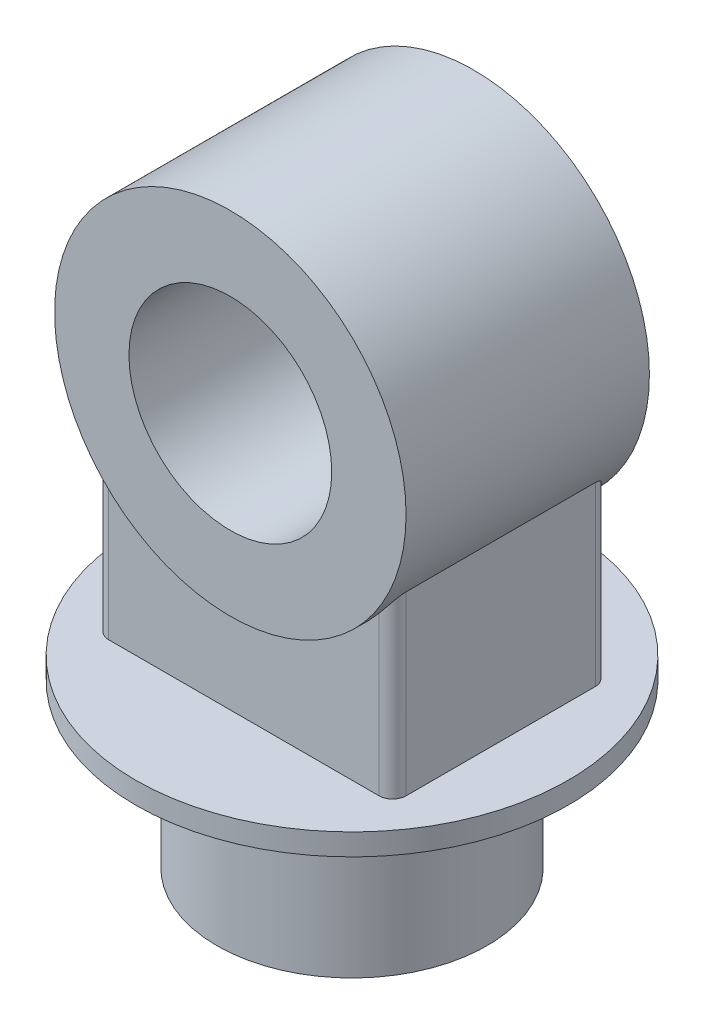
ISO-10303-21;
HEADER;
FILE_DESCRIPTION(('STEP AP214'),'2;1');
FILE_NAME('part.step','',(''),(''),'','','');
FILE_SCHEMA(('AUTOMOTIVE_DESIGN { 1 0 10303 214 1 1 1 1 }'));
ENDSEC;
DATA;
#1=APPLICATION_CONTEXT('core data for automotive mechanical design processes');
#2=APPLICATION_PROTOCOL_DEFINITION('international standard','automotive_design',2000,#1);
#3=PRODUCT_CONTEXT('',#1,'mechanical');
#4=PRODUCT('Part','Part','',(#3));
#5=PRODUCT_RELATED_PRODUCT_CATEGORY('part','',(#4));
#6=PRODUCT_DEFINITION_FORMATION('','',#4);
#7=PRODUCT_DEFINITION_CONTEXT('part definition',#1,'design');
#8=PRODUCT_DEFINITION('design','',#6,#7);
#9=PRODUCT_DEFINITION_SHAPE('','',#8);
#10=(LENGTH_UNIT() NAMED_UNIT(*) SI_UNIT(.MILLI.,.METRE.));
#11=(NAMED_UNIT(*) PLANE_ANGLE_UNIT() SI_UNIT($,.RADIAN.));
#12=(NAMED_UNIT(*) SI_UNIT($,.STERADIAN.) SOLID_ANGLE_UNIT());
#13=UNCERTAINTY_MEASURE_WITH_UNIT(LENGTH_MEASURE(1.E-05),#10,'distance_accuracy_value','');
#14=(GEOMETRIC_REPRESENTATION_CONTEXT(3) GLOBAL_UNCERTAINTY_ASSIGNED_CONTEXT((#13)) GLOBAL_UNIT_ASSIGNED_CONTEXT((#10,
#11,#12)) REPRESENTATION_CONTEXT('',''));
#15=CARTESIAN_POINT('',(0.,0.,0.));
#16=DIRECTION('',(0.,0.,1.));
#17=DIRECTION('',(1.,0.,0.));
#18=AXIS2_PLACEMENT_3D('',#15,#16,#17);
#19=CARTESIAN_POINT('',(0.,120.,0.));
#20=DIRECTION('',(0.,-1.,0.));
#21=DIRECTION('',(0.,0.,-1.));
#22=AXIS2_PLACEMENT_3D('',#19,#20,#21);
#23=CYLINDRICAL_SURFACE('',#22,100.);
#24=CARTESIAN_POINT('',(0.,120.,0.));
#25=DIRECTION('',(0.,1.,0.));
#26=DIRECTION('',(0.,0.,1.));
#27=AXIS2_PLACEMENT_3D('',#24,#25,#26);
#28=CIRCLE('',#27,100.);
#29=CARTESIAN_POINT('',(0.,120.,100.));
#30=VERTEX_POINT('',#29);
#31=EDGE_CURVE('E136',#30,#30,#28,.T.);
#32=ORIENTED_EDGE('',*,*,#31,.F.);
#33=EDGE_LOOP('',(#32));
#34=FACE_BOUND('',#33,.T.);
#35=CARTESIAN_POINT('',(0.,0.,0.));
#36=DIRECTION('',(0.,1.,0.));
#37=DIRECTION('',(0.,0.,1.));
#38=AXIS2_PLACEMENT_3D('',#35,#36,#37);
#39=CIRCLE('',#38,100.);
#40=CARTESIAN_POINT('',(0.,0.,100.));
#41=VERTEX_POINT('',#40);
#42=EDGE_CURVE('E210',#41,#41,#39,.T.);
#43=ORIENTED_EDGE('',*,*,#42,.T.);
#44=EDGE_LOOP('',(#43));
#45=FACE_BOUND('',#44,.T.);
#46=ADVANCED_FACE('F36',(#34,#45),#23,.T.);
#47=CARTESIAN_POINT('',(0.,0.,0.));
#48=DIRECTION('',(0.,1.,0.));
#49=DIRECTION('',(0.,0.,1.));
#50=AXIS2_PLACEMENT_3D('',#47,#48,#49);
#51=PLANE('',#50);
#52=ORIENTED_EDGE('',*,*,#42,.F.);
#53=EDGE_LOOP('',(#52));
#54=FACE_BOUND('',#53,.T.);
#55=ADVANCED_FACE('F219',(#54),#51,.F.);
#56=CARTESIAN_POINT('',(0.,136.,0.));
#57=DIRECTION('',(0.,-1.,0.));
#58=DIRECTION('',(0.,0.,-1.));
#59=AXIS2_PLACEMENT_3D('',#56,#57,#58);
#60=CYLINDRICAL_SURFACE('',#59,160.);
#61=CARTESIAN_POINT('',(0.,136.,0.));
#62=DIRECTION('',(0.,1.,0.));
#63=DIRECTION('',(0.,0.,1.));
#64=AXIS2_PLACEMENT_3D('',#61,#62,#63);
#65=CIRCLE('',#64,160.);
#66=CARTESIAN_POINT('',(0.,136.,160.));
#67=VERTEX_POINT('',#66);
#68=EDGE_CURVE('E207',#67,#67,#65,.T.);
#69=ORIENTED_EDGE('',*,*,#68,.F.);
#70=EDGE_LOOP('',(#69));
#71=FACE_BOUND('',#70,.T.);
#72=CARTESIAN_POINT('',(0.,120.,0.));
#73=DIRECTION('',(0.,1.,0.));
#74=DIRECTION('',(0.,0.,1.));
#75=AXIS2_PLACEMENT_3D('',#72,#73,#74);
#76=CIRCLE('',#75,160.);
#77=CARTESIAN_POINT('',(0.,120.,160.));
#78=VERTEX_POINT('',#77);
#79=EDGE_CURVE('E211',#78,#78,#76,.T.);
#80=ORIENTED_EDGE('',*,*,#79,.T.);
#81=EDGE_LOOP('',(#80));
#82=FACE_BOUND('',#81,.T.);
#83=ADVANCED_FACE('F221',(#71,#82),#60,.T.);
#84=CARTESIAN_POINT('',(0.,136.,0.));
#85=DIRECTION('',(0.,1.,0.));
#86=DIRECTION('',(0.,0.,1.));
#87=AXIS2_PLACEMENT_3D('',#84,#85,#86);
#88=PLANE('',#87);
#89=DIRECTION('',(0.,0.,-1.));
#90=VECTOR('',#89,1.);
#91=CARTESIAN_POINT('',(110.,136.,-80.));
#92=LINE('',#91,#90);
#93=CARTESIAN_POINT('',(110.,136.,70.));
#94=VERTEX_POINT('',#93);
#95=CARTESIAN_POINT('',(110.,136.,-70.));
#96=VERTEX_POINT('',#95);
#97=EDGE_CURVE('E187',#94,#96,#92,.T.);
#98=ORIENTED_EDGE('',*,*,#97,.F.);
#99=CARTESIAN_POINT('',(100.,136.,70.));
#100=DIRECTION('',(0.,1.,0.));
#101=DIRECTION('',(0.,0.,1.));
#102=AXIS2_PLACEMENT_3D('',#99,#100,#101);
#103=CIRCLE('',#102,10.);
#104=CARTESIAN_POINT('',(100.,136.,80.));
#105=VERTEX_POINT('',#104);
#106=EDGE_CURVE('E50',#94,#105,#103,.F.);
#107=ORIENTED_EDGE('',*,*,#106,.T.);
#108=DIRECTION('',(1.,0.,0.));
#109=VECTOR('',#108,1.);
#110=CARTESIAN_POINT('',(-110.,136.,80.));
#111=LINE('',#110,#109);
#112=CARTESIAN_POINT('',(-100.,136.,80.));
#113=VERTEX_POINT('',#112);
#114=EDGE_CURVE('E186',#113,#105,#111,.T.);
#115=ORIENTED_EDGE('',*,*,#114,.F.);
#116=CARTESIAN_POINT('',(-100.,136.,70.));
#117=DIRECTION('',(0.,1.,0.));
#118=DIRECTION('',(0.,0.,1.));
#119=AXIS2_PLACEMENT_3D('',#116,#117,#118);
#120=CIRCLE('',#119,10.);
#121=CARTESIAN_POINT('',(-110.,136.,70.));
#122=VERTEX_POINT('',#121);
#123=EDGE_CURVE('E119',#113,#122,#120,.F.);
#124=ORIENTED_EDGE('',*,*,#123,.T.);
#125=DIRECTION('',(0.,0.,1.));
#126=VECTOR('',#125,1.);
#127=CARTESIAN_POINT('',(-110.,136.,-80.));
#128=LINE('',#127,#126);
#129=CARTESIAN_POINT('',(-110.,136.,-70.));
#130=VERTEX_POINT('',#129);
#131=EDGE_CURVE('E188',#130,#122,#128,.T.);
#132=ORIENTED_EDGE('',*,*,#131,.F.);
#133=CARTESIAN_POINT('',(-100.,136.,-70.));
#134=DIRECTION('',(0.,1.,0.));
#135=DIRECTION('',(0.,0.,1.));
#136=AXIS2_PLACEMENT_3D('',#133,#134,#135);
#137=CIRCLE('',#136,10.);
#138=CARTESIAN_POINT('',(-100.,136.,-80.));
#139=VERTEX_POINT('',#138);
#140=EDGE_CURVE('E118',#130,#139,#137,.F.);
#141=ORIENTED_EDGE('',*,*,#140,.T.);
#142=DIRECTION('',(-1.,0.,0.));
#143=VECTOR('',#142,1.);
#144=CARTESIAN_POINT('',(-110.,136.,-80.));
#145=LINE('',#144,#143);
#146=CARTESIAN_POINT('',(100.,136.,-80.));
#147=VERTEX_POINT('',#146);
#148=EDGE_CURVE('E197',#147,#139,#145,.T.);
#149=ORIENTED_EDGE('',*,*,#148,.F.);
#150=CARTESIAN_POINT('',(100.,136.,-70.));
#151=DIRECTION('',(0.,1.,0.));
#152=DIRECTION('',(0.,0.,1.));
#153=AXIS2_PLACEMENT_3D('',#150,#151,#152);
#154=CIRCLE('',#153,10.);
#155=EDGE_CURVE('E57',#147,#96,#154,.F.);
#156=ORIENTED_EDGE('',*,*,#155,.T.);
#157=EDGE_LOOP('',(#98,#107,#115,#124,#132,#141,#149,#156));
#158=FACE_BOUND('',#157,.T.);
#159=ORIENTED_EDGE('',*,*,#68,.T.);
#160=EDGE_LOOP('',(#159));
#161=FACE_BOUND('',#160,.T.);
#162=ADVANCED_FACE('F184',(#158,#161),#88,.T.);
#163=CARTESIAN_POINT('',(0.,120.,0.));
#164=DIRECTION('',(0.,1.,0.));
#165=DIRECTION('',(0.,0.,1.));
#166=AXIS2_PLACEMENT_3D('',#163,#164,#165);
#167=PLANE('',#166);
#168=ORIENTED_EDGE('',*,*,#31,.T.);
#169=EDGE_LOOP('',(#168));
#170=FACE_BOUND('',#169,.T.);
#171=ORIENTED_EDGE('',*,*,#79,.F.);
#172=EDGE_LOOP('',(#171));
#173=FACE_BOUND('',#172,.T.);
#174=ADVANCED_FACE('F230',(#170,#173),#167,.F.);
#175=CARTESIAN_POINT('',(-110.,466.002,-80.));
#176=DIRECTION('',(0.,0.,1.));
#177=DIRECTION('',(1.,0.,0.));
#178=AXIS2_PLACEMENT_3D('',#175,#176,#177);
#179=PLANE('',#178);
#180=ORIENTED_EDGE('',*,*,#148,.T.);
#181=DIRECTION('',(0.,-1.,0.));
#182=VECTOR('',#181,1.);
#183=CARTESIAN_POINT('',(-100.,466.002,-80.));
#184=LINE('',#183,#182);
#185=CARTESIAN_POINT('',(-100.,252.933761370819,-80.));
#186=VERTEX_POINT('',#185);
#187=EDGE_CURVE('E144',#139,#186,#184,.F.);
#188=ORIENTED_EDGE('',*,*,#187,.T.);
#189=CARTESIAN_POINT('',(0.,336.,-80.));
#190=DIRECTION('',(0.,0.,1.));
#191=DIRECTION('',(1.,0.,0.));
#192=AXIS2_PLACEMENT_3D('',#189,#190,#191);
#193=CIRCLE('',#192,130.);
#194=CARTESIAN_POINT('',(100.,252.933761370819,-80.));
#195=VERTEX_POINT('',#194);
#196=EDGE_CURVE('E198',#195,#186,#193,.F.);
#197=ORIENTED_EDGE('',*,*,#196,.F.);
#198=DIRECTION('',(0.,-1.,0.));
#199=VECTOR('',#198,1.);
#200=CARTESIAN_POINT('',(100.,466.002,-80.));
#201=LINE('',#200,#199);
#202=EDGE_CURVE('E141',#195,#147,#201,.T.);
#203=ORIENTED_EDGE('',*,*,#202,.T.);
#204=EDGE_LOOP('',(#180,#188,#197,#203));
#205=FACE_BOUND('',#204,.T.);
#206=ADVANCED_FACE('F233',(#205),#179,.F.);
#207=CARTESIAN_POINT('',(110.,466.002,-80.));
#208=DIRECTION('',(-1.,0.,0.));
#209=DIRECTION('',(0.,0.,1.));
#210=AXIS2_PLACEMENT_3D('',#207,#208,#209);
#211=PLANE('',#210);
#212=ORIENTED_EDGE('',*,*,#97,.T.);
#213=DIRECTION('',(0.,-1.,0.));
#214=VECTOR('',#213,1.);
#215=CARTESIAN_POINT('',(110.,466.002,-70.));
#216=LINE('',#215,#214);
#217=CARTESIAN_POINT('',(110.,266.717967697245,-70.));
#218=VERTEX_POINT('',#217);
#219=EDGE_CURVE('E148',#96,#218,#216,.F.);
#220=ORIENTED_EDGE('',*,*,#219,.T.);
#221=DIRECTION('',(0.,0.,-1.));
#222=VECTOR('',#221,1.);
#223=CARTESIAN_POINT('',(110.,266.717967697245,90.));
#224=LINE('',#223,#222);
#225=CARTESIAN_POINT('',(110.,266.717967697245,70.));
#226=VERTEX_POINT('',#225);
#227=EDGE_CURVE('E192',#226,#218,#224,.T.);
#228=ORIENTED_EDGE('',*,*,#227,.F.);
#229=DIRECTION('',(0.,-1.,0.));
#230=VECTOR('',#229,1.);
#231=CARTESIAN_POINT('',(110.,466.002,70.));
#232=LINE('',#231,#230);
#233=EDGE_CURVE('E146',#226,#94,#232,.T.);
#234=ORIENTED_EDGE('',*,*,#233,.T.);
#235=EDGE_LOOP('',(#212,#220,#228,#234));
#236=FACE_BOUND('',#235,.T.);
#237=ADVANCED_FACE('F195',(#236),#211,.F.);
#238=CARTESIAN_POINT('',(-110.,466.002,-80.));
#239=DIRECTION('',(1.,0.,0.));
#240=DIRECTION('',(0.,0.,-1.));
#241=AXIS2_PLACEMENT_3D('',#238,#239,#240);
#242=PLANE('',#241);
#243=ORIENTED_EDGE('',*,*,#131,.T.);
#244=DIRECTION('',(0.,-1.,0.));
#245=VECTOR('',#244,1.);
#246=CARTESIAN_POINT('',(-110.,466.002,70.));
#247=LINE('',#246,#245);
#248=CARTESIAN_POINT('',(-110.,266.717967697245,70.));
#249=VERTEX_POINT('',#248);
#250=EDGE_CURVE('E134',#122,#249,#247,.F.);
#251=ORIENTED_EDGE('',*,*,#250,.T.);
#252=DIRECTION('',(0.,0.,-1.));
#253=VECTOR('',#252,1.);
#254=CARTESIAN_POINT('',(-110.,266.717967697245,90.));
#255=LINE('',#254,#253);
#256=CARTESIAN_POINT('',(-110.,266.717967697245,-69.9999999999999));
#257=VERTEX_POINT('',#256);
#258=EDGE_CURVE('E114',#257,#249,#255,.F.);
#259=ORIENTED_EDGE('',*,*,#258,.F.);
#260=DIRECTION('',(0.,-1.,0.));
#261=VECTOR('',#260,1.);
#262=CARTESIAN_POINT('',(-110.,466.002,-70.));
#263=LINE('',#262,#261);
#264=EDGE_CURVE('E131',#257,#130,#263,.T.);
#265=ORIENTED_EDGE('',*,*,#264,.T.);
#266=EDGE_LOOP('',(#243,#251,#259,#265));
#267=FACE_BOUND('',#266,.T.);
#268=ADVANCED_FACE('F239',(#267),#242,.F.);
#269=CARTESIAN_POINT('',(-110.,466.002,80.));
#270=DIRECTION('',(0.,0.,-1.));
#271=DIRECTION('',(-1.,0.,0.));
#272=AXIS2_PLACEMENT_3D('',#269,#270,#271);
#273=PLANE('',#272);
#274=CARTESIAN_POINT('',(0.,336.,80.));
#275=DIRECTION('',(0.,0.,-1.));
#276=DIRECTION('',(-1.,0.,0.));
#277=AXIS2_PLACEMENT_3D('',#274,#275,#276);
#278=CIRCLE('',#277,130.);
#279=CARTESIAN_POINT('',(-100.,252.933761370819,80.));
#280=VERTEX_POINT('',#279);
#281=CARTESIAN_POINT('',(100.,252.933761370819,80.));
#282=VERTEX_POINT('',#281);
#283=EDGE_CURVE('E111',#280,#282,#278,.F.);
#284=ORIENTED_EDGE('',*,*,#283,.F.);
#285=DIRECTION('',(0.,-1.,0.));
#286=VECTOR('',#285,1.);
#287=CARTESIAN_POINT('',(-100.,466.002,80.));
#288=LINE('',#287,#286);
#289=EDGE_CURVE('E125',#280,#113,#288,.T.);
#290=ORIENTED_EDGE('',*,*,#289,.T.);
#291=ORIENTED_EDGE('',*,*,#114,.T.);
#292=DIRECTION('',(0.,-1.,0.));
#293=VECTOR('',#292,1.);
#294=CARTESIAN_POINT('',(100.,466.002,80.));
#295=LINE('',#294,#293);
#296=EDGE_CURVE('E127',#105,#282,#295,.F.);
#297=ORIENTED_EDGE('',*,*,#296,.T.);
#298=EDGE_LOOP('',(#284,#290,#291,#297));
#299=FACE_BOUND('',#298,.T.);
#300=ADVANCED_FACE('F123',(#299),#273,.F.);
#301=CARTESIAN_POINT('',(0.,336.,90.));
#302=DIRECTION('',(0.,0.,-1.));
#303=DIRECTION('',(-1.,0.,0.));
#304=AXIS2_PLACEMENT_3D('',#301,#302,#303);
#305=CYLINDRICAL_SURFACE('',#304,130.);
#306=CARTESIAN_POINT('',(0.,336.,90.));
#307=DIRECTION('',(0.,0.,1.));
#308=DIRECTION('',(1.,0.,0.));
#309=AXIS2_PLACEMENT_3D('',#306,#307,#308);
#310=CIRCLE('',#309,130.);
#311=CARTESIAN_POINT('',(130.,336.,90.));
#312=VERTEX_POINT('',#311);
#313=EDGE_CURVE('E128',#312,#312,#310,.T.);
#314=ORIENTED_EDGE('',*,*,#313,.F.);
#315=EDGE_LOOP('',(#314));
#316=FACE_BOUND('',#315,.T.);
#317=CARTESIAN_POINT('',(0.,336.,-90.));
#318=DIRECTION('',(0.,0.,1.));
#319=DIRECTION('',(1.,0.,0.));
#320=AXIS2_PLACEMENT_3D('',#317,#318,#319);
#321=CIRCLE('',#320,130.);
#322=CARTESIAN_POINT('',(130.,336.,-90.));
#323=VERTEX_POINT('',#322);
#324=EDGE_CURVE('E257',#323,#323,#321,.T.);
#325=ORIENTED_EDGE('',*,*,#324,.T.);
#326=EDGE_LOOP('',(#325));
#327=FACE_BOUND('',#326,.T.);
#328=ORIENTED_EDGE('',*,*,#283,.T.);
#329=CARTESIAN_POINT('',(100.,252.933761370819,80.));
#330=CARTESIAN_POINT('',(100.223611151915,253.202952503255,79.9999830665315));
#331=CARTESIAN_POINT('',(100.446118360057,253.473036166024,79.9924995885085));
#332=CARTESIAN_POINT('',(100.888548742496,254.014496760122,79.9629173131463));
#333=CARTESIAN_POINT('',(101.108472043759,254.285873626978,79.9408192370116));
#334=CARTESIAN_POINT('',(101.545586290072,254.829711400373,79.8822979337703));
#335=CARTESIAN_POINT('',(101.76277446753,255.102173087004,79.8458612385231));
#336=CARTESIAN_POINT('',(102.193849033468,255.647413797012,79.7588609087488));
#337=CARTESIAN_POINT('',(102.407735374993,255.920192824843,79.7082970735217));
#338=CARTESIAN_POINT('',(103.048408055095,256.74400885936,79.5343891784366));
#339=CARTESIAN_POINT('',(103.469748368072,257.294974230618,79.3894263280958));
#340=CARTESIAN_POINT('',(104.088382224678,258.117224843771,79.1288060997197));
#341=CARTESIAN_POINT('',(104.292337034927,258.39057162742,79.0347525474724));
#342=CARTESIAN_POINT('',(104.695498702643,258.935304765081,78.8319429710982));
#343=CARTESIAN_POINT('',(104.894706004332,259.206691300842,78.7231883289499));
#344=CARTESIAN_POINT('',(105.336170271764,259.812965668139,78.4620472638272));
#345=CARTESIAN_POINT('',(105.577006541077,260.147108038148,78.3055009036513));
#346=CARTESIAN_POINT('',(106.04966094987,260.809343252621,77.967808626391));
#347=CARTESIAN_POINT('',(106.281479043935,261.137436066616,77.7866625854444));
#348=CARTESIAN_POINT('',(106.734152264033,261.784259610706,77.3986376161628));
#349=CARTESIAN_POINT('',(106.955036134368,262.103013877599,77.1918317878757));
#350=CARTESIAN_POINT('',(107.384708325122,262.728803605627,76.749894392022));
#351=CARTESIAN_POINT('',(107.593501627276,263.035843875289,76.5147746155492));
#352=CARTESIAN_POINT('',(107.921279015409,263.522080966666,76.1068757916446));
#353=CARTESIAN_POINT('',(108.044709884718,263.706240813682,75.9435605188263));
#354=CARTESIAN_POINT('',(108.284949666933,264.066582834907,75.6038296157538));
#355=CARTESIAN_POINT('',(108.401760304956,264.242767084986,75.4274174262629));
#356=CARTESIAN_POINT('',(108.627683741988,264.585236991633,75.0605773993746));
#357=CARTESIAN_POINT('',(108.736797961361,264.751524473746,74.8701521613913));
#358=CARTESIAN_POINT('',(108.945874410432,265.071634412635,74.4745306992528));
#359=CARTESIAN_POINT('',(109.04583974995,265.225461102935,74.2693395369045));
#360=CARTESIAN_POINT('',(109.274660386151,265.579056080623,73.7536743100227));
#361=CARTESIAN_POINT('',(109.398046362816,265.771031349643,73.4351396850743));
#362=CARTESIAN_POINT('',(109.561336457207,266.026263049992,72.9345418523036));
#363=CARTESIAN_POINT('',(109.612072269395,266.105785634321,72.7641622498837));
#364=CARTESIAN_POINT('',(109.705421847597,266.25239837099,72.4160328323223));
#365=CARTESIAN_POINT('',(109.748040656091,266.319496241142,72.2382876769633));
#366=CARTESIAN_POINT('',(109.820262744001,266.433384610412,71.8947331689276));
#367=CARTESIAN_POINT('',(109.850752312767,266.481551609067,71.729567610939));
#368=CARTESIAN_POINT('',(109.903691363628,266.565274678987,71.3948451418076));
#369=CARTESIAN_POINT('',(109.926143541964,266.600834979285,71.2252897238033));
#370=CARTESIAN_POINT('',(109.962659042777,266.658707696818,70.8807814271977));
#371=CARTESIAN_POINT('',(109.976613864032,266.680848750137,70.7057875562757));
#372=CARTESIAN_POINT('',(109.99061964662,266.703076138542,70.4419386674803));
#373=CARTESIAN_POINT('',(109.99413386492,266.708654625171,70.3536902139711));
#374=CARTESIAN_POINT('',(109.998824989492,266.716102079046,70.1769662160103));
#375=CARTESIAN_POINT('',(110.000001659485,266.717970671296,70.088490649507));
#376=CARTESIAN_POINT('',(110.,266.717967697245,70.));
#377=B_SPLINE_CURVE_WITH_KNOTS('',3,(#329,#330,#331,#332,#333,#334,#335,#336,#337,#338,#339,
#340,#341,#342,#343,#344,#345,#346,#347,#348,#349,#350,#351,#352,#353,#354,#355,#356,#357,#358,
#359,#360,#361,#362,#363,#364,#365,#366,#367,#368,#369,#370,#371,#372,#373,#374,#375,#376),
.UNSPECIFIED.,.F.,.F.,(4,2,2,2,2,2,2,2,2,2,2,2,2,2,2,2,2,2,2,2,2,2,2,4),(0.,1.04974156507783,
2.09943133114567,3.15010942417265,4.20080244462032,6.32356278933861,7.38465211465335,
8.44564176134501,9.76677685539398,11.087918601761,12.4053795382949,13.7222937149077,
14.5479419827464,15.3733741023698,16.1986534888326,17.0236513022889,18.194686650492,
18.7783719827905,19.3616935243415,19.8852298594992,20.4085904030381,20.9385006934629,
21.2038887699912,21.4693036704869),.UNSPECIFIED.);
#378=EDGE_CURVE('E11',#282,#226,#377,.T.);
#379=ORIENTED_EDGE('',*,*,#378,.T.);
#380=ORIENTED_EDGE('',*,*,#227,.T.);
#381=CARTESIAN_POINT('',(110.,266.717967697245,-70.));
#382=CARTESIAN_POINT('',(110.000033683462,266.718025852698,-70.1614230595313));
#383=CARTESIAN_POINT('',(109.996092792414,266.711764254296,-70.3228118197691));
#384=CARTESIAN_POINT('',(109.980519982779,266.687045880384,-70.6441123999957));
#385=CARTESIAN_POINT('',(109.968896213713,266.668602027069,-70.8040256031146));
#386=CARTESIAN_POINT('',(109.938376398954,266.620217986395,-71.1196424551221));
#387=CARTESIAN_POINT('',(109.919558261622,266.590400967593,-71.2753727040436));
#388=CARTESIAN_POINT('',(109.875071558334,266.52000006118,-71.5834085562726));
#389=CARTESIAN_POINT('',(109.849400846184,266.479412800404,-71.7357130704249));
#390=CARTESIAN_POINT('',(109.784772267017,266.377386983169,-72.0722520040974));
#391=CARTESIAN_POINT('',(109.744103525393,266.313281105856,-72.2553511890568));
#392=CARTESIAN_POINT('',(109.654040532803,266.17165023193,-72.6141464391851));
#393=CARTESIAN_POINT('',(109.604640075501,266.094115691273,-72.7898371277865));
#394=CARTESIAN_POINT('',(109.497968805892,265.927147418338,-73.1338723913451));
#395=CARTESIAN_POINT('',(109.440667457039,265.837667562915,-73.302184951541));
#396=CARTESIAN_POINT('',(109.319341126161,265.648779195145,-73.6304969218558));
#397=CARTESIAN_POINT('',(109.25531768694,265.549372961282,-73.7904982269664));
#398=CARTESIAN_POINT('',(109.085069343255,265.28590129292,-74.1868876463209));
#399=CARTESIAN_POINT('',(108.974781990569,265.115997241409,-74.4176642111939));
#400=CARTESIAN_POINT('',(108.742772943656,264.76058359918,-74.8607110351426));
#401=CARTESIAN_POINT('',(108.621044869784,264.575065307649,-75.072970840064));
#402=CARTESIAN_POINT('',(108.36794946479,264.19164129378,-75.4804206329534));
#403=CARTESIAN_POINT('',(108.236568322626,263.993717884812,-75.6755852518652));
#404=CARTESIAN_POINT('',(107.965814499919,263.588382733387,-76.0497203250661));
#405=CARTESIAN_POINT('',(107.826442440892,263.380971729107,-76.2286920360201));
#406=CARTESIAN_POINT('',(107.56145650763,262.989174407744,-76.5468161797372));
#407=CARTESIAN_POINT('',(107.436764821801,262.805791987749,-76.6879854690673));
#408=CARTESIAN_POINT('',(107.182869679799,262.434497987953,-76.9599552926783));
#409=CARTESIAN_POINT('',(107.053665586411,262.24658576965,-77.0907543539385));
#410=CARTESIAN_POINT('',(106.659844344167,261.677121003612,-77.4685356621901));
#411=CARTESIAN_POINT('',(106.389102445143,261.289965080353,-77.700802481696));
#412=CARTESIAN_POINT('',(105.833418194947,260.504836154638,-78.129863631631));
#413=CARTESIAN_POINT('',(105.548442441802,260.106838810795,-78.3265689888295));
#414=CARTESIAN_POINT('',(104.96676628824,259.304344779382,-78.6860846955171));
#415=CARTESIAN_POINT('',(104.670068038633,258.899849292081,-78.8489012287858));
#416=CARTESIAN_POINT('',(104.024574509401,258.030646711215,-79.1623550419402));
#417=CARTESIAN_POINT('',(103.674248758637,257.565348460988,-79.3081944572228));
#418=CARTESIAN_POINT('',(102.961876677953,256.632523338709,-79.558756520093));
#419=CARTESIAN_POINT('',(102.599828734006,256.16499616738,-79.6634734792563));
#420=CARTESIAN_POINT('',(102.051092736822,255.466397204689,-79.7891645729387));
#421=CARTESIAN_POINT('',(101.868137468165,255.235094848973,-79.8257282191264));
#422=CARTESIAN_POINT('',(101.499966150616,254.77288550036,-79.8886289353229));
#423=CARTESIAN_POINT('',(101.314750133026,254.541978502041,-79.9149661467555));
#424=CARTESIAN_POINT('',(100.942320486513,254.080919722901,-79.9572665465168));
#425=CARTESIAN_POINT('',(100.755107350153,253.850767773367,-79.9732322353467));
#426=CARTESIAN_POINT('',(100.378860262163,253.391449185777,-79.9945948234744));
#427=CARTESIAN_POINT('',(100.189826234412,253.162282589497,-79.9999912789888));
#428=CARTESIAN_POINT('',(100.,252.933761370819,-80.));
#429=B_SPLINE_CURVE_WITH_KNOTS('',3,(#381,#382,#383,#384,#385,#386,#387,#388,#389,#390,#391,
#392,#393,#394,#395,#396,#397,#398,#399,#400,#401,#402,#403,#404,#405,#406,#407,#408,#409,#410,
#411,#412,#413,#414,#415,#416,#417,#418,#419,#420,#421,#422,#423,#424,#425,#426,#427,#428),
.UNSPECIFIED.,.F.,.F.,(4,2,2,2,2,2,2,2,2,2,2,2,2,2,2,2,2,2,2,2,2,2,2,4),(0.,0.484045005923072,
0.967577389145415,1.44601544684505,1.92460352520314,2.51835043890468,3.11252108624078,
3.7090561398874,4.30545457926272,5.2251659536337,6.14539326092322,7.06696382284188,
7.9884628040196,8.77680092000531,9.56525081419886,11.1426900482286,12.7240229357797,
14.3050670200468,16.1047501551827,17.9046821508917,18.7960435003637,19.687392522541,
20.5785265668948,21.4696980275819),.UNSPECIFIED.);
#430=EDGE_CURVE('E179',#218,#195,#429,.T.);
#431=ORIENTED_EDGE('',*,*,#430,.T.);
#432=ORIENTED_EDGE('',*,*,#196,.T.);
#433=CARTESIAN_POINT('',(-100.,252.933761370819,-80.));
#434=CARTESIAN_POINT('',(-100.223611151915,253.202952503255,-79.9999830665315));
#435=CARTESIAN_POINT('',(-100.446118360057,253.473036166024,-79.9924995885084));
#436=CARTESIAN_POINT('',(-100.888548742496,254.014496760122,-79.9629173131463));
#437=CARTESIAN_POINT('',(-101.108472043759,254.285873626978,-79.9408192370115));
#438=CARTESIAN_POINT('',(-101.545586290072,254.829711400373,-79.8822979337703));
#439=CARTESIAN_POINT('',(-101.76277446753,255.102173087004,-79.8458612385231));
#440=CARTESIAN_POINT('',(-102.193849033468,255.647413797012,-79.7588609087488));
#441=CARTESIAN_POINT('',(-102.407735374993,255.920192824843,-79.7082970735217));
#442=CARTESIAN_POINT('',(-103.048408055095,256.74400885936,-79.5343891784366));
#443=CARTESIAN_POINT('',(-103.469748368072,257.294974230618,-79.3894263280957));
#444=CARTESIAN_POINT('',(-104.088382224678,258.117224843771,-79.1288060997197));
#445=CARTESIAN_POINT('',(-104.292337034927,258.39057162742,-79.0347525474724));
#446=CARTESIAN_POINT('',(-104.695498702643,258.935304765081,-78.8319429710981));
#447=CARTESIAN_POINT('',(-104.894706004332,259.206691300842,-78.7231883289499));
#448=CARTESIAN_POINT('',(-105.336170271764,259.812965668139,-78.4620472638272));
#449=CARTESIAN_POINT('',(-105.577006541077,260.147108038148,-78.3055009036513));
#450=CARTESIAN_POINT('',(-106.04966094987,260.809343252621,-77.967808626391));
#451=CARTESIAN_POINT('',(-106.281479043935,261.137436066616,-77.7866625854443));
#452=CARTESIAN_POINT('',(-106.734152264033,261.784259610706,-77.3986376161628));
#453=CARTESIAN_POINT('',(-106.955036134368,262.103013877598,-77.1918317878757));
#454=CARTESIAN_POINT('',(-107.384708325122,262.728803605627,-76.749894392022));
#455=CARTESIAN_POINT('',(-107.593501627276,263.035843875289,-76.5147746155492));
#456=CARTESIAN_POINT('',(-107.921279015409,263.522080966666,-76.1068757916445));
#457=CARTESIAN_POINT('',(-108.044709884718,263.706240813682,-75.9435605188262));
#458=CARTESIAN_POINT('',(-108.284949666933,264.066582834907,-75.6038296157537));
#459=CARTESIAN_POINT('',(-108.401760304956,264.242767084986,-75.4274174262628));
#460=CARTESIAN_POINT('',(-108.627683741988,264.585236991633,-75.0605773993746));
#461=CARTESIAN_POINT('',(-108.736797961361,264.751524473746,-74.8701521613912));
#462=CARTESIAN_POINT('',(-108.945874410432,265.071634412635,-74.4745306992527));
#463=CARTESIAN_POINT('',(-109.04583974995,265.225461102935,-74.2693395369045));
#464=CARTESIAN_POINT('',(-109.274660386151,265.579056080623,-73.7536743100226));
#465=CARTESIAN_POINT('',(-109.398046362816,265.771031349643,-73.4351396850741));
#466=CARTESIAN_POINT('',(-109.561336457207,266.026263049992,-72.9345418523035));
#467=CARTESIAN_POINT('',(-109.612072269395,266.105785634321,-72.7641622498836));
#468=CARTESIAN_POINT('',(-109.705421847597,266.25239837099,-72.4160328323222));
#469=CARTESIAN_POINT('',(-109.748040656091,266.319496241142,-72.2382876769632));
#470=CARTESIAN_POINT('',(-109.820262744001,266.433384610412,-71.8947331689276));
#471=CARTESIAN_POINT('',(-109.850752312767,266.481551609067,-71.729567610939));
#472=CARTESIAN_POINT('',(-109.903691363628,266.565274678987,-71.3948451418076));
#473=CARTESIAN_POINT('',(-109.926143541964,266.600834979285,-71.2252897238033));
#474=CARTESIAN_POINT('',(-109.962659042777,266.658707696818,-70.8807814271977));
#475=CARTESIAN_POINT('',(-109.976613864032,266.680848750137,-70.7057875562757));
#476=CARTESIAN_POINT('',(-109.99061964662,266.703076138542,-70.4419386674803));
#477=CARTESIAN_POINT('',(-109.99413386492,266.708654625171,-70.3536902139711));
#478=CARTESIAN_POINT('',(-109.998824989492,266.716102079046,-70.1769662160102));
#479=CARTESIAN_POINT('',(-110.000001659485,266.717970671296,-70.088490649507));
#480=CARTESIAN_POINT('',(-110.,266.717967697245,-70.));
#481=B_SPLINE_CURVE_WITH_KNOTS('',3,(#433,#434,#435,#436,#437,#438,#439,#440,#441,#442,#443,
#444,#445,#446,#447,#448,#449,#450,#451,#452,#453,#454,#455,#456,#457,#458,#459,#460,#461,#462,
#463,#464,#465,#466,#467,#468,#469,#470,#471,#472,#473,#474,#475,#476,#477,#478,#479,#480),
.UNSPECIFIED.,.F.,.F.,(4,2,2,2,2,2,2,2,2,2,2,2,2,2,2,2,2,2,2,2,2,2,2,4),(0.,1.04974156507783,
2.09943133114567,3.15010942417265,4.20080244462032,6.32356278933861,7.38465211465335,
8.44564176134501,9.76677685539396,11.0879186017609,12.4053795382948,13.7222937149077,
14.5479419827464,15.3733741023698,16.1986534888326,17.023651302289,18.194686650492,
18.7783719827905,19.3616935243415,19.8852298594992,20.4085904030381,20.9385006934629,
21.2038887699912,21.4693036704869),.UNSPECIFIED.);
#482=EDGE_CURVE('E172',#186,#257,#481,.T.);
#483=ORIENTED_EDGE('',*,*,#482,.T.);
#484=ORIENTED_EDGE('',*,*,#258,.T.);
#485=CARTESIAN_POINT('',(-110.,266.717967697245,70.));
#486=CARTESIAN_POINT('',(-110.000033683462,266.718025852698,70.1614230595313));
#487=CARTESIAN_POINT('',(-109.996092792414,266.711764254296,70.3228118197691));
#488=CARTESIAN_POINT('',(-109.980519982779,266.687045880384,70.6441123999958));
#489=CARTESIAN_POINT('',(-109.968896213713,266.668602027069,70.8040256031146));
#490=CARTESIAN_POINT('',(-109.938376398954,266.620217986395,71.1196424551221));
#491=CARTESIAN_POINT('',(-109.919558261622,266.590400967593,71.2753727040436));
#492=CARTESIAN_POINT('',(-109.875071558334,266.52000006118,71.5834085562726));
#493=CARTESIAN_POINT('',(-109.849400846184,266.479412800404,71.7357130704249));
#494=CARTESIAN_POINT('',(-109.784772267017,266.377386983169,72.0722520040974));
#495=CARTESIAN_POINT('',(-109.744103525393,266.313281105856,72.2553511890568));
#496=CARTESIAN_POINT('',(-109.654040532803,266.17165023193,72.6141464391851));
#497=CARTESIAN_POINT('',(-109.604640075501,266.094115691273,72.7898371277865));
#498=CARTESIAN_POINT('',(-109.497968805892,265.927147418338,73.1338723913451));
#499=CARTESIAN_POINT('',(-109.440667457039,265.837667562915,73.3021849515411));
#500=CARTESIAN_POINT('',(-109.319341126161,265.648779195145,73.6304969218558));
#501=CARTESIAN_POINT('',(-109.25531768694,265.549372961282,73.7904982269664));
#502=CARTESIAN_POINT('',(-109.085069343255,265.28590129292,74.1868876463209));
#503=CARTESIAN_POINT('',(-108.974781990569,265.115997241409,74.4176642111939));
#504=CARTESIAN_POINT('',(-108.742772943656,264.76058359918,74.8607110351426));
#505=CARTESIAN_POINT('',(-108.621044869784,264.575065307649,75.072970840064));
#506=CARTESIAN_POINT('',(-108.36794946479,264.19164129378,75.4804206329535));
#507=CARTESIAN_POINT('',(-108.236568322626,263.993717884812,75.6755852518652));
#508=CARTESIAN_POINT('',(-107.965814499919,263.588382733387,76.0497203250662));
#509=CARTESIAN_POINT('',(-107.826442440892,263.380971729107,76.2286920360201));
#510=CARTESIAN_POINT('',(-107.56145650763,262.989174407744,76.5468161797372));
#511=CARTESIAN_POINT('',(-107.436764821801,262.805791987749,76.6879854690674));
#512=CARTESIAN_POINT('',(-107.182869679799,262.434497987953,76.9599552926783));
#513=CARTESIAN_POINT('',(-107.053665586411,262.24658576965,77.0907543539386));
#514=CARTESIAN_POINT('',(-106.659844344167,261.677121003612,77.4685356621902));
#515=CARTESIAN_POINT('',(-106.389102445143,261.289965080353,77.7008024816961));
#516=CARTESIAN_POINT('',(-105.833418194947,260.504836154638,78.129863631631));
#517=CARTESIAN_POINT('',(-105.548442441802,260.106838810795,78.3265689888296));
#518=CARTESIAN_POINT('',(-104.96676628824,259.304344779382,78.6860846955172));
#519=CARTESIAN_POINT('',(-104.670068038633,258.899849292081,78.8489012287858));
#520=CARTESIAN_POINT('',(-104.024574509401,258.030646711215,79.1623550419402));
#521=CARTESIAN_POINT('',(-103.674248758637,257.565348460988,79.3081944572228));
#522=CARTESIAN_POINT('',(-102.961876677953,256.632523338709,79.558756520093));
#523=CARTESIAN_POINT('',(-102.599828734006,256.16499616738,79.6634734792563));
#524=CARTESIAN_POINT('',(-102.051092736822,255.466397204689,79.7891645729388));
#525=CARTESIAN_POINT('',(-101.868137468165,255.235094848973,79.8257282191265));
#526=CARTESIAN_POINT('',(-101.499966150616,254.77288550036,79.8886289353229));
#527=CARTESIAN_POINT('',(-101.314750133026,254.541978502041,79.9149661467555));
#528=CARTESIAN_POINT('',(-100.942320486513,254.080919722901,79.9572665465168));
#529=CARTESIAN_POINT('',(-100.755107350153,253.850767773367,79.9732322353467));
#530=CARTESIAN_POINT('',(-100.378860262163,253.391449185777,79.9945948234744));
#531=CARTESIAN_POINT('',(-100.189826234412,253.162282589497,79.9999912789888));
#532=CARTESIAN_POINT('',(-100.,252.933761370819,80.));
#533=B_SPLINE_CURVE_WITH_KNOTS('',3,(#485,#486,#487,#488,#489,#490,#491,#492,#493,#494,#495,
#496,#497,#498,#499,#500,#501,#502,#503,#504,#505,#506,#507,#508,#509,#510,#511,#512,#513,#514,
#515,#516,#517,#518,#519,#520,#521,#522,#523,#524,#525,#526,#527,#528,#529,#530,#531,#532),
.UNSPECIFIED.,.F.,.F.,(4,2,2,2,2,2,2,2,2,2,2,2,2,2,2,2,2,2,2,2,2,2,2,4),(0.,0.484045005923084,
0.967577389145426,1.44601544684507,1.92460352520314,2.51835043890468,3.11252108624077,
3.70905613988742,4.30545457926274,5.22516595363374,6.14539326092328,7.06696382284191,
7.98846280401964,8.77680092000539,9.56525081419896,11.1426900482287,12.7240229357798,
14.305067020047,16.1047501551828,17.9046821508917,18.7960435003637,19.6873925225409,
20.5785265668947,21.4696980275819),.UNSPECIFIED.);
#534=EDGE_CURVE('E108',#249,#280,#533,.T.);
#535=ORIENTED_EDGE('',*,*,#534,.T.);
#536=EDGE_LOOP('',(#328,#379,#380,#431,#432,#483,#484,#535));
#537=FACE_BOUND('',#536,.T.);
#538=ADVANCED_FACE('F110',(#316,#327,#537),#305,.T.);
#539=CARTESIAN_POINT('',(0.,336.,90.));
#540=DIRECTION('',(0.,0.,1.));
#541=DIRECTION('',(1.,0.,0.));
#542=AXIS2_PLACEMENT_3D('',#539,#540,#541);
#543=PLANE('',#542);
#544=ORIENTED_EDGE('',*,*,#313,.T.);
#545=EDGE_LOOP('',(#544));
#546=FACE_BOUND('',#545,.T.);
#547=CARTESIAN_POINT('',(0.,336.,90.));
#548=DIRECTION('',(0.,0.,1.));
#549=DIRECTION('',(1.,0.,0.));
#550=AXIS2_PLACEMENT_3D('',#547,#548,#549);
#551=CIRCLE('',#550,75.);
#552=CARTESIAN_POINT('',(-75.,336.,90.));
#553=VERTEX_POINT('',#552);
#554=EDGE_CURVE('E260',#553,#553,#551,.T.);
#555=ORIENTED_EDGE('',*,*,#554,.F.);
#556=EDGE_LOOP('',(#555));
#557=FACE_BOUND('',#556,.T.);
#558=ADVANCED_FACE('F271',(#546,#557),#543,.T.);
#559=CARTESIAN_POINT('',(0.,336.,-90.));
#560=DIRECTION('',(0.,0.,1.));
#561=DIRECTION('',(1.,0.,0.));
#562=AXIS2_PLACEMENT_3D('',#559,#560,#561);
#563=PLANE('',#562);
#564=ORIENTED_EDGE('',*,*,#324,.F.);
#565=EDGE_LOOP('',(#564));
#566=FACE_BOUND('',#565,.T.);
#567=CARTESIAN_POINT('',(0.,336.,-90.));
#568=DIRECTION('',(0.,0.,1.));
#569=DIRECTION('',(1.,0.,0.));
#570=AXIS2_PLACEMENT_3D('',#567,#568,#569);
#571=CIRCLE('',#570,75.);
#572=CARTESIAN_POINT('',(-75.,336.,-90.));
#573=VERTEX_POINT('',#572);
#574=EDGE_CURVE('E263',#573,#573,#571,.T.);
#575=ORIENTED_EDGE('',*,*,#574,.T.);
#576=EDGE_LOOP('',(#575));
#577=FACE_BOUND('',#576,.T.);
#578=ADVANCED_FACE('F273',(#566,#577),#563,.F.);
#579=CARTESIAN_POINT('',(0.,336.,90.));
#580=DIRECTION('',(0.,0.,-1.));
#581=DIRECTION('',(-1.,0.,0.));
#582=AXIS2_PLACEMENT_3D('',#579,#580,#581);
#583=CYLINDRICAL_SURFACE('',#582,75.);
#584=CARTESIAN_POINT('',(-75.,336.,90.));
#585=CARTESIAN_POINT('',(-75.,336.,88.125));
#586=CARTESIAN_POINT('',(-75.,336.,86.25));
#587=CARTESIAN_POINT('',(-75.,336.,82.5));
#588=CARTESIAN_POINT('',(-75.,336.,80.625));
#589=CARTESIAN_POINT('',(-75.,336.,76.875));
#590=CARTESIAN_POINT('',(-75.,336.,75.));
#591=CARTESIAN_POINT('',(-75.,336.,71.25));
#592=CARTESIAN_POINT('',(-75.,336.,69.375));
#593=CARTESIAN_POINT('',(-75.,336.,65.625));
#594=CARTESIAN_POINT('',(-75.,336.,63.75));
#595=CARTESIAN_POINT('',(-75.,336.,60.));
#596=CARTESIAN_POINT('',(-75.,336.,58.125));
#597=CARTESIAN_POINT('',(-75.,336.,54.375));
#598=CARTESIAN_POINT('',(-75.,336.,52.5));
#599=CARTESIAN_POINT('',(-75.,336.,48.75));
#600=CARTESIAN_POINT('',(-75.,336.,46.875));
#601=CARTESIAN_POINT('',(-75.,336.,43.125));
#602=CARTESIAN_POINT('',(-75.,336.,41.25));
#603=CARTESIAN_POINT('',(-75.,336.,37.5));
#604=CARTESIAN_POINT('',(-75.,336.,35.625));
#605=CARTESIAN_POINT('',(-75.,336.,31.875));
#606=CARTESIAN_POINT('',(-75.,336.,30.));
#607=CARTESIAN_POINT('',(-75.,336.,26.25));
#608=CARTESIAN_POINT('',(-75.,336.,24.375));
#609=CARTESIAN_POINT('',(-75.,336.,20.625));
#610=CARTESIAN_POINT('',(-75.,336.,18.75));
#611=CARTESIAN_POINT('',(-75.,336.,15.));
#612=CARTESIAN_POINT('',(-75.,336.,13.125));
#613=CARTESIAN_POINT('',(-75.,336.,9.37499999999998));
#614=CARTESIAN_POINT('',(-75.,336.,7.49999999999998));
#615=CARTESIAN_POINT('',(-75.,336.,3.74999999999998));
#616=CARTESIAN_POINT('',(-75.,336.,1.87499999999997));
#617=CARTESIAN_POINT('',(-75.,336.,-1.87500000000003));
#618=CARTESIAN_POINT('',(-75.,336.,-3.75000000000003));
#619=CARTESIAN_POINT('',(-75.,336.,-7.50000000000003));
#620=CARTESIAN_POINT('',(-75.,336.,-9.37500000000004));
#621=CARTESIAN_POINT('',(-75.,336.,-13.125));
#622=CARTESIAN_POINT('',(-75.,336.,-15.));
#623=CARTESIAN_POINT('',(-75.,336.,-18.75));
#624=CARTESIAN_POINT('',(-75.,336.,-20.625));
#625=CARTESIAN_POINT('',(-75.,336.,-24.375));
#626=CARTESIAN_POINT('',(-75.,336.,-26.25));
#627=CARTESIAN_POINT('',(-75.,336.,-30.));
#628=CARTESIAN_POINT('',(-75.,336.,-31.875));
#629=CARTESIAN_POINT('',(-75.,336.,-35.625));
#630=CARTESIAN_POINT('',(-75.,336.,-37.5));
#631=CARTESIAN_POINT('',(-75.,336.,-41.25));
#632=CARTESIAN_POINT('',(-75.,336.,-43.125));
#633=CARTESIAN_POINT('',(-75.,336.,-46.875));
#634=CARTESIAN_POINT('',(-75.,336.,-48.75));
#635=CARTESIAN_POINT('',(-75.,336.,-52.5));
#636=CARTESIAN_POINT('',(-75.,336.,-54.375));
#637=CARTESIAN_POINT('',(-75.,336.,-58.125));
#638=CARTESIAN_POINT('',(-75.,336.,-60.));
#639=CARTESIAN_POINT('',(-75.,336.,-63.75));
#640=CARTESIAN_POINT('',(-75.,336.,-65.625));
#641=CARTESIAN_POINT('',(-75.,336.,-69.375));
#642=CARTESIAN_POINT('',(-75.,336.,-71.25));
#643=CARTESIAN_POINT('',(-75.,336.,-75.));
#644=CARTESIAN_POINT('',(-75.,336.,-76.875));
#645=CARTESIAN_POINT('',(-75.,336.,-80.625));
#646=CARTESIAN_POINT('',(-75.,336.,-82.5));
#647=CARTESIAN_POINT('',(-75.,336.,-86.25));
#648=CARTESIAN_POINT('',(-75.,336.,-88.125));
#649=CARTESIAN_POINT('',(-75.,336.,-90.));
#650=B_SPLINE_CURVE_WITH_KNOTS('',3,(#584,#585,#586,#587,#588,#589,#590,#591,#592,#593,#594,
#595,#596,#597,#598,#599,#600,#601,#602,#603,#604,#605,#606,#607,#608,#609,#610,#611,#612,#613,
#614,#615,#616,#617,#618,#619,#620,#621,#622,#623,#624,#625,#626,#627,#628,#629,#630,#631,#632,
#633,#634,#635,#636,#637,#638,#639,#640,#641,#642,#643,#644,#645,#646,#647,#648,#649),
.UNSPECIFIED.,.F.,.F.,(4,2,2,2,2,2,2,2,2,2,2,2,2,2,2,2,2,2,2,2,2,2,2,2,2,2,2,2,2,2,2,2,4),(0.,
5.62499999999999,11.25,16.875,22.5,28.125,33.75,39.375,45.,50.625,56.25,61.875,67.5,73.125,
78.75,84.375,90.,95.625,101.25,106.875,112.5,118.125,123.75,129.375,135.,140.625,146.25,151.875,
157.5,163.125,168.75,174.375,180.),.UNSPECIFIED.);
#651=EDGE_CURVE('BSEAM165',#553,#573,#650,.T.);
#652=ORIENTED_EDGE('',*,*,#554,.T.);
#653=ORIENTED_EDGE('',*,*,#574,.F.);
#654=ORIENTED_EDGE('',*,*,#651,.T.);
#655=ORIENTED_EDGE('',*,*,#651,.F.);
#656=EDGE_LOOP('',(#652,#654,#653,#655));
#657=FACE_BOUND('',#656,.T.);
#658=ADVANCED_FACE('F165',(#657),#583,.F.);
#659=CARTESIAN_POINT('',(-100.,466.002,70.));
#660=DIRECTION('',(0.,-1.,0.));
#661=DIRECTION('',(0.,0.,-1.));
#662=AXIS2_PLACEMENT_3D('',#659,#660,#661);
#663=CYLINDRICAL_SURFACE('',#662,10.);
#664=ORIENTED_EDGE('',*,*,#534,.F.);
#665=ORIENTED_EDGE('',*,*,#250,.F.);
#666=ORIENTED_EDGE('',*,*,#123,.F.);
#667=ORIENTED_EDGE('',*,*,#289,.F.);
#668=EDGE_LOOP('',(#664,#665,#666,#667));
#669=FACE_BOUND('',#668,.T.);
#670=ADVANCED_FACE('F130',(#669),#663,.T.);
#671=CARTESIAN_POINT('',(-100.,466.002,-70.));
#672=DIRECTION('',(0.,-1.,0.));
#673=DIRECTION('',(0.,0.,-1.));
#674=AXIS2_PLACEMENT_3D('',#671,#672,#673);
#675=CYLINDRICAL_SURFACE('',#674,10.);
#676=ORIENTED_EDGE('',*,*,#482,.F.);
#677=ORIENTED_EDGE('',*,*,#187,.F.);
#678=ORIENTED_EDGE('',*,*,#140,.F.);
#679=ORIENTED_EDGE('',*,*,#264,.F.);
#680=EDGE_LOOP('',(#676,#677,#678,#679));
#681=FACE_BOUND('',#680,.T.);
#682=ADVANCED_FACE('F164',(#681),#675,.T.);
#683=CARTESIAN_POINT('',(100.,466.002,-70.));
#684=DIRECTION('',(0.,-1.,0.));
#685=DIRECTION('',(0.,0.,-1.));
#686=AXIS2_PLACEMENT_3D('',#683,#684,#685);
#687=CYLINDRICAL_SURFACE('',#686,10.);
#688=ORIENTED_EDGE('',*,*,#430,.F.);
#689=ORIENTED_EDGE('',*,*,#219,.F.);
#690=ORIENTED_EDGE('',*,*,#155,.F.);
#691=ORIENTED_EDGE('',*,*,#202,.F.);
#692=EDGE_LOOP('',(#688,#689,#690,#691));
#693=FACE_BOUND('',#692,.T.);
#694=ADVANCED_FACE('F169',(#693),#687,.T.);
#695=CARTESIAN_POINT('',(100.,466.002,70.));
#696=DIRECTION('',(0.,-1.,0.));
#697=DIRECTION('',(0.,0.,-1.));
#698=AXIS2_PLACEMENT_3D('',#695,#696,#697);
#699=CYLINDRICAL_SURFACE('',#698,10.);
#700=ORIENTED_EDGE('',*,*,#378,.F.);
#701=ORIENTED_EDGE('',*,*,#296,.F.);
#702=ORIENTED_EDGE('',*,*,#106,.F.);
#703=ORIENTED_EDGE('',*,*,#233,.F.);
#704=EDGE_LOOP('',(#700,#701,#702,#703));
#705=FACE_BOUND('',#704,.T.);
#706=ADVANCED_FACE('F38',(#705),#699,.T.);
#707=CLOSED_SHELL('',(#46,#55,#83,#162,#174,#206,#237,#268,#300,#538,#558,#578,#658,#670,#682,
#694,#706));
#708=MANIFOLD_SOLID_BREP('B2',#707);
#709=ADVANCED_BREP_SHAPE_REPRESENTATION('',(#18,#708),#14);
#710=SHAPE_DEFINITION_REPRESENTATION(#9,#709);
ENDSEC;
END-ISO-10303-21;
